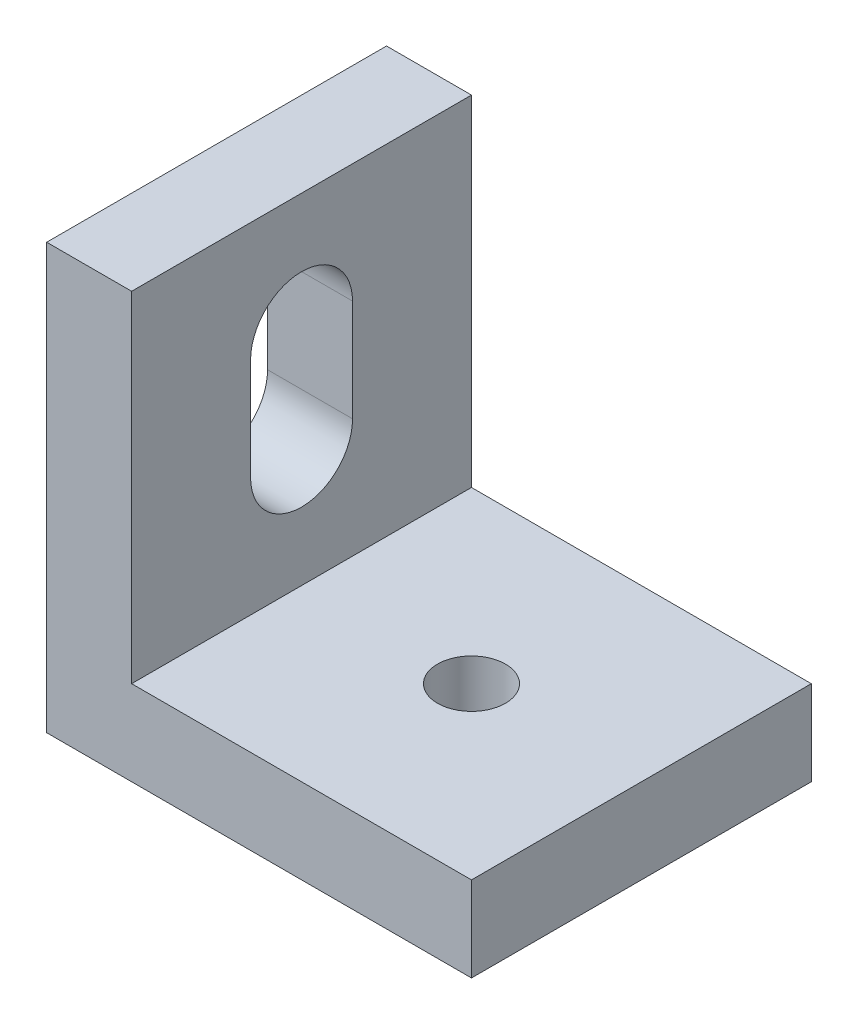
ISO-10303-21;
HEADER;
FILE_DESCRIPTION(('STEP AP214'),'2;1');
FILE_NAME('part.step','',(''),(''),'','','');
FILE_SCHEMA(('AUTOMOTIVE_DESIGN { 1 0 10303 214 1 1 1 1 }'));
ENDSEC;
DATA;
#1=APPLICATION_CONTEXT('core data for automotive mechanical design processes');
#2=APPLICATION_PROTOCOL_DEFINITION('international standard','automotive_design',2000,#1);
#3=PRODUCT_CONTEXT('',#1,'mechanical');
#4=PRODUCT('Part','Part','',(#3));
#5=PRODUCT_RELATED_PRODUCT_CATEGORY('part','',(#4));
#6=PRODUCT_DEFINITION_FORMATION('','',#4);
#7=PRODUCT_DEFINITION_CONTEXT('part definition',#1,'design');
#8=PRODUCT_DEFINITION('design','',#6,#7);
#9=PRODUCT_DEFINITION_SHAPE('','',#8);
#10=(LENGTH_UNIT() NAMED_UNIT(*) SI_UNIT(.MILLI.,.METRE.));
#11=(NAMED_UNIT(*) PLANE_ANGLE_UNIT() SI_UNIT($,.RADIAN.));
#12=(NAMED_UNIT(*) SI_UNIT($,.STERADIAN.) SOLID_ANGLE_UNIT());
#13=UNCERTAINTY_MEASURE_WITH_UNIT(LENGTH_MEASURE(1.E-05),#10,'distance_accuracy_value','');
#14=(GEOMETRIC_REPRESENTATION_CONTEXT(3) GLOBAL_UNCERTAINTY_ASSIGNED_CONTEXT((#13)) GLOBAL_UNIT_ASSIGNED_CONTEXT((#10,
#11,#12)) REPRESENTATION_CONTEXT('',''));
#15=CARTESIAN_POINT('',(0.,0.,0.));
#16=DIRECTION('',(0.,0.,1.));
#17=DIRECTION('',(1.,0.,0.));
#18=AXIS2_PLACEMENT_3D('',#15,#16,#17);
#19=CARTESIAN_POINT('',(-10.,25.,10.));
#20=DIRECTION('',(1.,0.,0.));
#21=DIRECTION('',(0.,0.,-1.));
#22=AXIS2_PLACEMENT_3D('',#19,#20,#21);
#23=PLANE('',#22);
#24=DIRECTION('',(0.,0.,1.));
#25=VECTOR('',#24,1.);
#26=CARTESIAN_POINT('',(-10.,5.,-10.));
#27=LINE('',#26,#25);
#28=CARTESIAN_POINT('',(-10.,5.,-10.));
#29=VERTEX_POINT('',#28);
#30=CARTESIAN_POINT('',(-10.,5.,10.));
#31=VERTEX_POINT('',#30);
#32=EDGE_CURVE('E176',#29,#31,#27,.T.);
#33=ORIENTED_EDGE('',*,*,#32,.F.);
#34=DIRECTION('',(0.,-1.,0.));
#35=VECTOR('',#34,1.);
#36=CARTESIAN_POINT('',(-10.,25.,-10.));
#37=LINE('',#36,#35);
#38=CARTESIAN_POINT('',(-10.,25.,-10.));
#39=VERTEX_POINT('',#38);
#40=EDGE_CURVE('E155',#39,#29,#37,.T.);
#41=ORIENTED_EDGE('',*,*,#40,.F.);
#42=DIRECTION('',(0.,0.,1.));
#43=VECTOR('',#42,1.);
#44=CARTESIAN_POINT('',(-10.,25.,10.));
#45=LINE('',#44,#43);
#46=CARTESIAN_POINT('',(-10.,25.,10.));
#47=VERTEX_POINT('',#46);
#48=EDGE_CURVE('E146',#39,#47,#45,.T.);
#49=ORIENTED_EDGE('',*,*,#48,.T.);
#50=DIRECTION('',(0.,-1.,0.));
#51=VECTOR('',#50,1.);
#52=CARTESIAN_POINT('',(-10.,25.,10.));
#53=LINE('',#52,#51);
#54=EDGE_CURVE('E152',#47,#31,#53,.T.);
#55=ORIENTED_EDGE('',*,*,#54,.T.);
#56=EDGE_LOOP('',(#33,#41,#49,#55));
#57=FACE_BOUND('',#56,.T.);
#58=DIRECTION('',(0.,-1.,0.));
#59=VECTOR('',#58,1.);
#60=CARTESIAN_POINT('',(-10.,0.,3.));
#61=LINE('',#60,#59);
#62=CARTESIAN_POINT('',(-10.,18.,3.));
#63=VERTEX_POINT('',#62);
#64=CARTESIAN_POINT('',(-10.,12.,3.));
#65=VERTEX_POINT('',#64);
#66=EDGE_CURVE('E122',#63,#65,#61,.T.);
#67=ORIENTED_EDGE('',*,*,#66,.F.);
#68=CARTESIAN_POINT('',(-10.,18.,0.));
#69=DIRECTION('',(1.,0.,0.));
#70=DIRECTION('',(0.,0.,-1.));
#71=AXIS2_PLACEMENT_3D('',#68,#69,#70);
#72=CIRCLE('',#71,3.);
#73=CARTESIAN_POINT('',(-10.,18.,-3.));
#74=VERTEX_POINT('',#73);
#75=EDGE_CURVE('E48',#63,#74,#72,.F.);
#76=ORIENTED_EDGE('',*,*,#75,.T.);
#77=DIRECTION('',(0.,-1.,0.));
#78=VECTOR('',#77,1.);
#79=CARTESIAN_POINT('',(-10.,0.,-3.));
#80=LINE('',#79,#78);
#81=CARTESIAN_POINT('',(-10.,12.,-3.));
#82=VERTEX_POINT('',#81);
#83=EDGE_CURVE('E127',#74,#82,#80,.T.);
#84=ORIENTED_EDGE('',*,*,#83,.T.);
#85=CARTESIAN_POINT('',(-10.,12.,0.));
#86=DIRECTION('',(1.,0.,0.));
#87=DIRECTION('',(0.,0.,-1.));
#88=AXIS2_PLACEMENT_3D('',#85,#86,#87);
#89=CIRCLE('',#88,3.);
#90=EDGE_CURVE('E113',#82,#65,#89,.F.);
#91=ORIENTED_EDGE('',*,*,#90,.T.);
#92=EDGE_LOOP('',(#67,#76,#84,#91));
#93=FACE_BOUND('',#92,.T.);
#94=ADVANCED_FACE('F33',(#57,#93),#23,.T.);
#95=CARTESIAN_POINT('',(-15.,25.,10.));
#96=DIRECTION('',(-1.,0.,0.));
#97=DIRECTION('',(0.,0.,1.));
#98=AXIS2_PLACEMENT_3D('',#95,#96,#97);
#99=PLANE('',#98);
#100=DIRECTION('',(0.,0.,-1.));
#101=VECTOR('',#100,1.);
#102=CARTESIAN_POINT('',(-15.,0.,10.));
#103=LINE('',#102,#101);
#104=CARTESIAN_POINT('',(-15.,0.,10.));
#105=VERTEX_POINT('',#104);
#106=CARTESIAN_POINT('',(-15.,0.,-10.));
#107=VERTEX_POINT('',#106);
#108=EDGE_CURVE('E134',#105,#107,#103,.T.);
#109=ORIENTED_EDGE('',*,*,#108,.F.);
#110=DIRECTION('',(0.,-1.,0.));
#111=VECTOR('',#110,1.);
#112=CARTESIAN_POINT('',(-15.,25.,10.));
#113=LINE('',#112,#111);
#114=CARTESIAN_POINT('',(-15.,25.,10.));
#115=VERTEX_POINT('',#114);
#116=EDGE_CURVE('E149',#115,#105,#113,.T.);
#117=ORIENTED_EDGE('',*,*,#116,.F.);
#118=DIRECTION('',(0.,0.,-1.));
#119=VECTOR('',#118,1.);
#120=CARTESIAN_POINT('',(-15.,25.,10.));
#121=LINE('',#120,#119);
#122=CARTESIAN_POINT('',(-15.,25.,-10.));
#123=VERTEX_POINT('',#122);
#124=EDGE_CURVE('E140',#115,#123,#121,.T.);
#125=ORIENTED_EDGE('',*,*,#124,.T.);
#126=DIRECTION('',(0.,-1.,0.));
#127=VECTOR('',#126,1.);
#128=CARTESIAN_POINT('',(-15.,25.,-10.));
#129=LINE('',#128,#127);
#130=EDGE_CURVE('E158',#123,#107,#129,.T.);
#131=ORIENTED_EDGE('',*,*,#130,.T.);
#132=EDGE_LOOP('',(#109,#117,#125,#131));
#133=FACE_BOUND('',#132,.T.);
#134=DIRECTION('',(0.,1.,0.));
#135=VECTOR('',#134,1.);
#136=CARTESIAN_POINT('',(-15.,25.,-3.));
#137=LINE('',#136,#135);
#138=CARTESIAN_POINT('',(-15.,12.,-3.));
#139=VERTEX_POINT('',#138);
#140=CARTESIAN_POINT('',(-15.,18.,-3.));
#141=VERTEX_POINT('',#140);
#142=EDGE_CURVE('E41',#139,#141,#137,.T.);
#143=ORIENTED_EDGE('',*,*,#142,.T.);
#144=CARTESIAN_POINT('',(-15.,18.,0.));
#145=DIRECTION('',(-1.,0.,0.));
#146=DIRECTION('',(0.,0.,1.));
#147=AXIS2_PLACEMENT_3D('',#144,#145,#146);
#148=CIRCLE('',#147,3.);
#149=CARTESIAN_POINT('',(-15.,18.,3.));
#150=VERTEX_POINT('',#149);
#151=EDGE_CURVE('E11',#141,#150,#148,.F.);
#152=ORIENTED_EDGE('',*,*,#151,.T.);
#153=DIRECTION('',(0.,1.,0.));
#154=VECTOR('',#153,1.);
#155=CARTESIAN_POINT('',(-15.,25.,3.));
#156=LINE('',#155,#154);
#157=CARTESIAN_POINT('',(-15.,12.,3.));
#158=VERTEX_POINT('',#157);
#159=EDGE_CURVE('E192',#158,#150,#156,.T.);
#160=ORIENTED_EDGE('',*,*,#159,.F.);
#161=CARTESIAN_POINT('',(-15.,12.,0.));
#162=DIRECTION('',(-1.,0.,0.));
#163=DIRECTION('',(0.,0.,1.));
#164=AXIS2_PLACEMENT_3D('',#161,#162,#163);
#165=CIRCLE('',#164,3.);
#166=EDGE_CURVE('E116',#158,#139,#165,.F.);
#167=ORIENTED_EDGE('',*,*,#166,.T.);
#168=EDGE_LOOP('',(#143,#152,#160,#167));
#169=FACE_BOUND('',#168,.T.);
#170=ADVANCED_FACE('F196',(#133,#169),#99,.T.);
#171=CARTESIAN_POINT('',(0.,5.,0.));
#172=DIRECTION('',(0.,1.,0.));
#173=DIRECTION('',(0.,0.,1.));
#174=AXIS2_PLACEMENT_3D('',#171,#172,#173);
#175=PLANE('',#174);
#176=DIRECTION('',(0.,0.,-1.));
#177=VECTOR('',#176,1.);
#178=CARTESIAN_POINT('',(10.,5.,-10.));
#179=LINE('',#178,#177);
#180=CARTESIAN_POINT('',(10.,5.,10.));
#181=VERTEX_POINT('',#180);
#182=CARTESIAN_POINT('',(10.,5.,-10.));
#183=VERTEX_POINT('',#182);
#184=EDGE_CURVE('E169',#181,#183,#179,.T.);
#185=ORIENTED_EDGE('',*,*,#184,.T.);
#186=DIRECTION('',(-1.,0.,0.));
#187=VECTOR('',#186,1.);
#188=CARTESIAN_POINT('',(-10.,5.,-10.));
#189=LINE('',#188,#187);
#190=EDGE_CURVE('E172',#183,#29,#189,.T.);
#191=ORIENTED_EDGE('',*,*,#190,.T.);
#192=ORIENTED_EDGE('',*,*,#32,.T.);
#193=DIRECTION('',(1.,0.,0.));
#194=VECTOR('',#193,1.);
#195=CARTESIAN_POINT('',(-10.,5.,10.));
#196=LINE('',#195,#194);
#197=EDGE_CURVE('E179',#31,#181,#196,.T.);
#198=ORIENTED_EDGE('',*,*,#197,.T.);
#199=EDGE_LOOP('',(#185,#191,#192,#198));
#200=FACE_BOUND('',#199,.T.);
#201=CARTESIAN_POINT('',(0.,5.,0.));
#202=DIRECTION('',(0.,1.,0.));
#203=DIRECTION('',(0.,0.,1.));
#204=AXIS2_PLACEMENT_3D('',#201,#202,#203);
#205=CIRCLE('',#204,2.);
#206=CARTESIAN_POINT('',(0.,5.,2.));
#207=VERTEX_POINT('',#206);
#208=EDGE_CURVE('E163',#207,#207,#205,.T.);
#209=ORIENTED_EDGE('',*,*,#208,.F.);
#210=EDGE_LOOP('',(#209));
#211=FACE_BOUND('',#210,.T.);
#212=ADVANCED_FACE('F219',(#200,#211),#175,.T.);
#213=CARTESIAN_POINT('',(0.,0.,0.));
#214=DIRECTION('',(0.,1.,0.));
#215=DIRECTION('',(0.,0.,1.));
#216=AXIS2_PLACEMENT_3D('',#213,#214,#215);
#217=PLANE('',#216);
#218=DIRECTION('',(0.,0.,-1.));
#219=VECTOR('',#218,1.);
#220=CARTESIAN_POINT('',(10.,0.,-10.));
#221=LINE('',#220,#219);
#222=CARTESIAN_POINT('',(10.,0.,10.));
#223=VERTEX_POINT('',#222);
#224=CARTESIAN_POINT('',(10.,0.,-10.));
#225=VERTEX_POINT('',#224);
#226=EDGE_CURVE('E166',#223,#225,#221,.T.);
#227=ORIENTED_EDGE('',*,*,#226,.F.);
#228=DIRECTION('',(1.,0.,0.));
#229=VECTOR('',#228,1.);
#230=CARTESIAN_POINT('',(-10.,0.,10.));
#231=LINE('',#230,#229);
#232=EDGE_CURVE('E173',#105,#223,#231,.T.);
#233=ORIENTED_EDGE('',*,*,#232,.F.);
#234=ORIENTED_EDGE('',*,*,#108,.T.);
#235=DIRECTION('',(-1.,0.,0.));
#236=VECTOR('',#235,1.);
#237=CARTESIAN_POINT('',(-10.,0.,-10.));
#238=LINE('',#237,#236);
#239=EDGE_CURVE('E184',#225,#107,#238,.T.);
#240=ORIENTED_EDGE('',*,*,#239,.F.);
#241=EDGE_LOOP('',(#227,#233,#234,#240));
#242=FACE_BOUND('',#241,.T.);
#243=CARTESIAN_POINT('',(0.,0.,0.));
#244=DIRECTION('',(0.,1.,0.));
#245=DIRECTION('',(0.,0.,1.));
#246=AXIS2_PLACEMENT_3D('',#243,#244,#245);
#247=CIRCLE('',#246,2.);
#248=CARTESIAN_POINT('',(0.,0.,2.));
#249=VERTEX_POINT('',#248);
#250=EDGE_CURVE('E154',#249,#249,#247,.T.);
#251=ORIENTED_EDGE('',*,*,#250,.T.);
#252=EDGE_LOOP('',(#251));
#253=FACE_BOUND('',#252,.T.);
#254=ADVANCED_FACE('F229',(#242,#253),#217,.F.);
#255=CARTESIAN_POINT('',(10.,5.,-10.));
#256=DIRECTION('',(-1.,0.,0.));
#257=DIRECTION('',(0.,0.,1.));
#258=AXIS2_PLACEMENT_3D('',#255,#256,#257);
#259=PLANE('',#258);
#260=ORIENTED_EDGE('',*,*,#226,.T.);
#261=DIRECTION('',(0.,-1.,0.));
#262=VECTOR('',#261,1.);
#263=CARTESIAN_POINT('',(10.,5.,-10.));
#264=LINE('',#263,#262);
#265=EDGE_CURVE('E189',#183,#225,#264,.T.);
#266=ORIENTED_EDGE('',*,*,#265,.F.);
#267=ORIENTED_EDGE('',*,*,#184,.F.);
#268=DIRECTION('',(0.,-1.,0.));
#269=VECTOR('',#268,1.);
#270=CARTESIAN_POINT('',(10.,5.,10.));
#271=LINE('',#270,#269);
#272=EDGE_CURVE('E181',#181,#223,#271,.T.);
#273=ORIENTED_EDGE('',*,*,#272,.T.);
#274=EDGE_LOOP('',(#260,#266,#267,#273));
#275=FACE_BOUND('',#274,.T.);
#276=ADVANCED_FACE('F35',(#275),#259,.F.);
#277=CARTESIAN_POINT('',(-10.,5.,-10.));
#278=DIRECTION('',(0.,0.,1.));
#279=DIRECTION('',(1.,0.,0.));
#280=AXIS2_PLACEMENT_3D('',#277,#278,#279);
#281=PLANE('',#280);
#282=ORIENTED_EDGE('',*,*,#239,.T.);
#283=ORIENTED_EDGE('',*,*,#130,.F.);
#284=DIRECTION('',(1.,0.,0.));
#285=VECTOR('',#284,1.);
#286=CARTESIAN_POINT('',(-10.,25.,-10.));
#287=LINE('',#286,#285);
#288=EDGE_CURVE('E143',#123,#39,#287,.T.);
#289=ORIENTED_EDGE('',*,*,#288,.T.);
#290=ORIENTED_EDGE('',*,*,#40,.T.);
#291=ORIENTED_EDGE('',*,*,#190,.F.);
#292=ORIENTED_EDGE('',*,*,#265,.T.);
#293=EDGE_LOOP('',(#282,#283,#289,#290,#291,#292));
#294=FACE_BOUND('',#293,.T.);
#295=ADVANCED_FACE('F235',(#294),#281,.F.);
#296=CARTESIAN_POINT('',(-10.,5.,10.));
#297=DIRECTION('',(0.,0.,-1.));
#298=DIRECTION('',(-1.,0.,0.));
#299=AXIS2_PLACEMENT_3D('',#296,#297,#298);
#300=PLANE('',#299);
#301=ORIENTED_EDGE('',*,*,#232,.T.);
#302=ORIENTED_EDGE('',*,*,#272,.F.);
#303=ORIENTED_EDGE('',*,*,#197,.F.);
#304=ORIENTED_EDGE('',*,*,#54,.F.);
#305=DIRECTION('',(-1.,0.,0.));
#306=VECTOR('',#305,1.);
#307=CARTESIAN_POINT('',(-10.,25.,10.));
#308=LINE('',#307,#306);
#309=EDGE_CURVE('E137',#47,#115,#308,.T.);
#310=ORIENTED_EDGE('',*,*,#309,.T.);
#311=ORIENTED_EDGE('',*,*,#116,.T.);
#312=EDGE_LOOP('',(#301,#302,#303,#304,#310,#311));
#313=FACE_BOUND('',#312,.T.);
#314=ADVANCED_FACE('F225',(#313),#300,.F.);
#315=CARTESIAN_POINT('',(0.,5.,0.));
#316=DIRECTION('',(0.,-1.,0.));
#317=DIRECTION('',(0.,0.,-1.));
#318=AXIS2_PLACEMENT_3D('',#315,#316,#317);
#319=CYLINDRICAL_SURFACE('',#318,2.);
#320=ORIENTED_EDGE('',*,*,#208,.T.);
#321=EDGE_LOOP('',(#320));
#322=FACE_BOUND('',#321,.T.);
#323=ORIENTED_EDGE('',*,*,#250,.F.);
#324=EDGE_LOOP('',(#323));
#325=FACE_BOUND('',#324,.T.);
#326=ADVANCED_FACE('F209',(#322,#325),#319,.F.);
#327=CARTESIAN_POINT('',(0.,25.,0.));
#328=DIRECTION('',(0.,-1.,0.));
#329=DIRECTION('',(0.,0.,-1.));
#330=AXIS2_PLACEMENT_3D('',#327,#328,#329);
#331=PLANE('',#330);
#332=ORIENTED_EDGE('',*,*,#309,.F.);
#333=ORIENTED_EDGE('',*,*,#48,.F.);
#334=ORIENTED_EDGE('',*,*,#288,.F.);
#335=ORIENTED_EDGE('',*,*,#124,.F.);
#336=EDGE_LOOP('',(#332,#333,#334,#335));
#337=FACE_BOUND('',#336,.T.);
#338=ADVANCED_FACE('F202',(#337),#331,.F.);
#339=CARTESIAN_POINT('',(-35.,18.,0.));
#340=DIRECTION('',(1.,0.,0.));
#341=DIRECTION('',(0.,0.,-1.));
#342=AXIS2_PLACEMENT_3D('',#339,#340,#341);
#343=CYLINDRICAL_SURFACE('',#342,3.);
#344=DIRECTION('',(1.,0.,0.));
#345=VECTOR('',#344,1.);
#346=CARTESIAN_POINT('',(-35.,18.,-3.));
#347=LINE('',#346,#345);
#348=EDGE_CURVE('E132',#141,#74,#347,.T.);
#349=ORIENTED_EDGE('',*,*,#348,.T.);
#350=ORIENTED_EDGE('',*,*,#75,.F.);
#351=DIRECTION('',(1.,0.,0.));
#352=VECTOR('',#351,1.);
#353=CARTESIAN_POINT('',(-35.,18.,3.));
#354=LINE('',#353,#352);
#355=EDGE_CURVE('E119',#150,#63,#354,.T.);
#356=ORIENTED_EDGE('',*,*,#355,.F.);
#357=ORIENTED_EDGE('',*,*,#151,.F.);
#358=EDGE_LOOP('',(#349,#350,#356,#357));
#359=FACE_BOUND('',#358,.T.);
#360=ADVANCED_FACE('F200',(#359),#343,.F.);
#361=CARTESIAN_POINT('',(-35.,0.,-3.));
#362=DIRECTION('',(0.,0.,1.));
#363=DIRECTION('',(0.,-1.,0.));
#364=AXIS2_PLACEMENT_3D('',#361,#362,#363);
#365=PLANE('',#364);
#366=DIRECTION('',(1.,0.,0.));
#367=VECTOR('',#366,1.);
#368=CARTESIAN_POINT('',(-35.,12.,-3.));
#369=LINE('',#368,#367);
#370=EDGE_CURVE('E118',#139,#82,#369,.T.);
#371=ORIENTED_EDGE('',*,*,#370,.T.);
#372=ORIENTED_EDGE('',*,*,#83,.F.);
#373=ORIENTED_EDGE('',*,*,#348,.F.);
#374=ORIENTED_EDGE('',*,*,#142,.F.);
#375=EDGE_LOOP('',(#371,#372,#373,#374));
#376=FACE_BOUND('',#375,.T.);
#377=ADVANCED_FACE('F199',(#376),#365,.T.);
#378=CARTESIAN_POINT('',(-35.,12.,0.));
#379=DIRECTION('',(1.,0.,0.));
#380=DIRECTION('',(0.,0.,-1.));
#381=AXIS2_PLACEMENT_3D('',#378,#379,#380);
#382=CYLINDRICAL_SURFACE('',#381,3.);
#383=DIRECTION('',(1.,0.,0.));
#384=VECTOR('',#383,1.);
#385=CARTESIAN_POINT('',(-35.,12.,3.));
#386=LINE('',#385,#384);
#387=EDGE_CURVE('E56',#158,#65,#386,.T.);
#388=ORIENTED_EDGE('',*,*,#387,.T.);
#389=ORIENTED_EDGE('',*,*,#90,.F.);
#390=ORIENTED_EDGE('',*,*,#370,.F.);
#391=ORIENTED_EDGE('',*,*,#166,.F.);
#392=EDGE_LOOP('',(#388,#389,#390,#391));
#393=FACE_BOUND('',#392,.T.);
#394=ADVANCED_FACE('F110',(#393),#382,.F.);
#395=CARTESIAN_POINT('',(-35.,0.,3.));
#396=DIRECTION('',(0.,0.,1.));
#397=DIRECTION('',(0.,-1.,0.));
#398=AXIS2_PLACEMENT_3D('',#395,#396,#397);
#399=PLANE('',#398);
#400=ORIENTED_EDGE('',*,*,#159,.T.);
#401=ORIENTED_EDGE('',*,*,#355,.T.);
#402=ORIENTED_EDGE('',*,*,#66,.T.);
#403=ORIENTED_EDGE('',*,*,#387,.F.);
#404=EDGE_LOOP('',(#400,#401,#402,#403));
#405=FACE_BOUND('',#404,.T.);
#406=ADVANCED_FACE('F123',(#405),#399,.F.);
#407=CLOSED_SHELL('',(#94,#170,#212,#254,#276,#295,#314,#326,#338,#360,#377,#394,#406));
#408=MANIFOLD_SOLID_BREP('B2',#407);
#409=ADVANCED_BREP_SHAPE_REPRESENTATION('',(#18,#408),#14);
#410=SHAPE_DEFINITION_REPRESENTATION(#9,#409);
ENDSEC;
END-ISO-10303-21;
